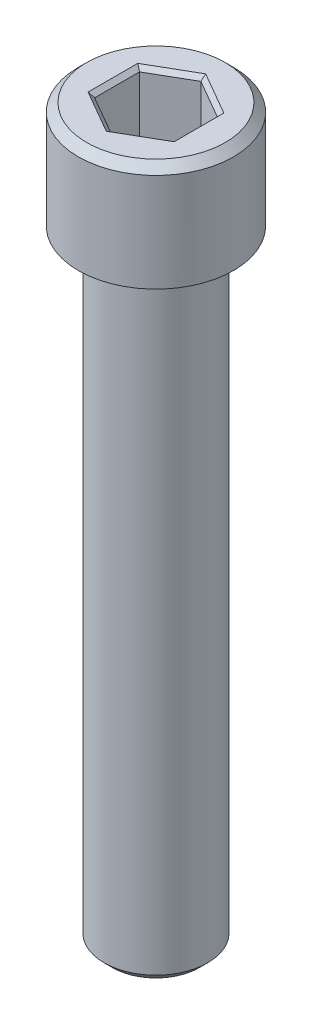
ISO-10303-21;
HEADER;
FILE_DESCRIPTION(('STEP AP214'),'2;1');
FILE_NAME('part.step','',(''),(''),'','','');
FILE_SCHEMA(('AUTOMOTIVE_DESIGN { 1 0 10303 214 1 1 1 1 }'));
ENDSEC;
DATA;
#1=APPLICATION_CONTEXT('core data for automotive mechanical design processes');
#2=APPLICATION_PROTOCOL_DEFINITION('international standard','automotive_design',2000,#1);
#3=PRODUCT_CONTEXT('',#1,'mechanical');
#4=PRODUCT('Part','Part','',(#3));
#5=PRODUCT_RELATED_PRODUCT_CATEGORY('part','',(#4));
#6=PRODUCT_DEFINITION_FORMATION('','',#4);
#7=PRODUCT_DEFINITION_CONTEXT('part definition',#1,'design');
#8=PRODUCT_DEFINITION('design','',#6,#7);
#9=PRODUCT_DEFINITION_SHAPE('','',#8);
#10=(LENGTH_UNIT() NAMED_UNIT(*) SI_UNIT(.MILLI.,.METRE.));
#11=(NAMED_UNIT(*) PLANE_ANGLE_UNIT() SI_UNIT($,.RADIAN.));
#12=(NAMED_UNIT(*) SI_UNIT($,.STERADIAN.) SOLID_ANGLE_UNIT());
#13=UNCERTAINTY_MEASURE_WITH_UNIT(LENGTH_MEASURE(1.E-05),#10,'distance_accuracy_value','');
#14=(GEOMETRIC_REPRESENTATION_CONTEXT(3) GLOBAL_UNCERTAINTY_ASSIGNED_CONTEXT((#13)) GLOBAL_UNIT_ASSIGNED_CONTEXT((#10,
#11,#12)) REPRESENTATION_CONTEXT('',''));
#15=CARTESIAN_POINT('',(0.,0.,0.));
#16=DIRECTION('',(0.,0.,1.));
#17=DIRECTION('',(1.,0.,0.));
#18=AXIS2_PLACEMENT_3D('',#15,#16,#17);
#19=CARTESIAN_POINT('',(-4.77519999999997,-4.57200000000002,0.));
#20=DIRECTION('',(0.,-1.,0.));
#21=DIRECTION('',(0.,0.,-1.));
#22=AXIS2_PLACEMENT_3D('',#19,#20,#21);
#23=PLANE('',#22);
#24=DIRECTION('',(-0.866025403784438,0.,0.5));
#25=VECTOR('',#24,1.);
#26=CARTESIAN_POINT('',(2.3876,-4.57200000000002,1.37848150271715));
#27=LINE('',#26,#25);
#28=CARTESIAN_POINT('',(2.3876,-4.57200000000002,1.37848150271715));
#29=VERTEX_POINT('',#28);
#30=CARTESIAN_POINT('',(0.,-4.57200000000002,2.7569630054343));
#31=VERTEX_POINT('',#30);
#32=EDGE_CURVE('E86',#29,#31,#27,.T.);
#33=ORIENTED_EDGE('',*,*,#32,.F.);
#34=DIRECTION('',(0.,0.,1.));
#35=VECTOR('',#34,1.);
#36=CARTESIAN_POINT('',(2.3876,-4.57200000000002,-1.37848150271715));
#37=LINE('',#36,#35);
#38=CARTESIAN_POINT('',(2.3876,-4.57200000000002,-1.37848150271715));
#39=VERTEX_POINT('',#38);
#40=EDGE_CURVE('E91',#39,#29,#37,.T.);
#41=ORIENTED_EDGE('',*,*,#40,.F.);
#42=DIRECTION('',(0.866025403784438,0.,0.5));
#43=VECTOR('',#42,1.);
#44=CARTESIAN_POINT('',(0.,-4.57200000000002,-2.75696300543429));
#45=LINE('',#44,#43);
#46=CARTESIAN_POINT('',(0.,-4.57200000000002,-2.75696300543429));
#47=VERTEX_POINT('',#46);
#48=EDGE_CURVE('E172',#47,#39,#45,.T.);
#49=ORIENTED_EDGE('',*,*,#48,.F.);
#50=DIRECTION('',(0.866025403784438,0.,-0.5));
#51=VECTOR('',#50,1.);
#52=CARTESIAN_POINT('',(-2.38759999999999,-4.57200000000002,-1.37848150271714));
#53=LINE('',#52,#51);
#54=CARTESIAN_POINT('',(-2.38759999999997,-4.57200000000002,-1.37848150271714));
#55=VERTEX_POINT('',#54);
#56=EDGE_CURVE('E178',#55,#47,#53,.T.);
#57=ORIENTED_EDGE('',*,*,#56,.F.);
#58=DIRECTION('',(0.,0.,-1.));
#59=VECTOR('',#58,1.);
#60=CARTESIAN_POINT('',(-2.38759999999996,-4.57200000000002,1.37848150271717));
#61=LINE('',#60,#59);
#62=CARTESIAN_POINT('',(-2.38759999999996,-4.57200000000002,1.37848150271717));
#63=VERTEX_POINT('',#62);
#64=EDGE_CURVE('E183',#63,#55,#61,.T.);
#65=ORIENTED_EDGE('',*,*,#64,.F.);
#66=DIRECTION('',(-0.866025403784438,0.,-0.500000000000001));
#67=VECTOR('',#66,1.);
#68=CARTESIAN_POINT('',(0.,-4.57200000000002,2.75696300543431));
#69=LINE('',#68,#67);
#70=EDGE_CURVE('E102',#31,#63,#69,.T.);
#71=ORIENTED_EDGE('',*,*,#70,.F.);
#72=EDGE_LOOP('',(#33,#41,#49,#57,#65,#71));
#73=FACE_BOUND('',#72,.T.);
#74=ADVANCED_FACE('F17',(#73),#23,.F.);
#75=CARTESIAN_POINT('',(2.3876,-4.57200000000002,-1.37848150271715));
#76=DIRECTION('',(-1.,0.,0.));
#77=DIRECTION('',(0.,0.,1.));
#78=AXIS2_PLACEMENT_3D('',#75,#76,#77);
#79=PLANE('',#78);
#80=DIRECTION('',(0.,1.,0.));
#81=VECTOR('',#80,1.);
#82=CARTESIAN_POINT('',(2.3876,-4.57200000000002,-1.37848150271715));
#83=LINE('',#82,#81);
#84=CARTESIAN_POINT('',(2.38760000000001,-0.253999999999981,-1.37848150271715));
#85=VERTEX_POINT('',#84);
#86=EDGE_CURVE('E96',#39,#85,#83,.T.);
#87=ORIENTED_EDGE('',*,*,#86,.F.);
#88=ORIENTED_EDGE('',*,*,#40,.T.);
#89=DIRECTION('',(0.,1.,0.));
#90=VECTOR('',#89,1.);
#91=CARTESIAN_POINT('',(2.3876,-4.57200000000002,1.37848150271715));
#92=LINE('',#91,#90);
#93=CARTESIAN_POINT('',(2.38760000000001,-0.25399999999998,1.37848150271715));
#94=VERTEX_POINT('',#93);
#95=EDGE_CURVE('E93',#94,#29,#92,.F.);
#96=ORIENTED_EDGE('',*,*,#95,.F.);
#97=DIRECTION('',(0.,0.,1.));
#98=VECTOR('',#97,1.);
#99=CARTESIAN_POINT('',(2.38760000000002,-0.25399999999999,0.));
#100=LINE('',#99,#98);
#101=EDGE_CURVE('E170',#94,#85,#100,.F.);
#102=ORIENTED_EDGE('',*,*,#101,.T.);
#103=EDGE_LOOP('',(#87,#88,#96,#102));
#104=FACE_BOUND('',#103,.T.);
#105=ADVANCED_FACE('F92',(#104),#79,.T.);
#106=CARTESIAN_POINT('',(2.3876,-4.57200000000002,1.37848150271715));
#107=DIRECTION('',(-0.5,0.,-0.866025403784438));
#108=DIRECTION('',(-0.866025403784438,0.,0.5));
#109=AXIS2_PLACEMENT_3D('',#106,#107,#108);
#110=PLANE('',#109);
#111=ORIENTED_EDGE('',*,*,#95,.T.);
#112=ORIENTED_EDGE('',*,*,#32,.T.);
#113=DIRECTION('',(0.,1.,0.));
#114=VECTOR('',#113,1.);
#115=CARTESIAN_POINT('',(0.,-4.57200000000002,2.75696300543431));
#116=LINE('',#115,#114);
#117=CARTESIAN_POINT('',(0.,-0.253999999999979,2.75696300543431));
#118=VERTEX_POINT('',#117);
#119=EDGE_CURVE('E104',#118,#31,#116,.F.);
#120=ORIENTED_EDGE('',*,*,#119,.F.);
#121=DIRECTION('',(0.866025403784438,0.,-0.500000000000001));
#122=VECTOR('',#121,1.);
#123=CARTESIAN_POINT('',(0.,-0.253999999999987,2.75696300543432));
#124=LINE('',#123,#122);
#125=EDGE_CURVE('E108',#118,#94,#124,.T.);
#126=ORIENTED_EDGE('',*,*,#125,.T.);
#127=EDGE_LOOP('',(#111,#112,#120,#126));
#128=FACE_BOUND('',#127,.T.);
#129=ADVANCED_FACE('F106',(#128),#110,.T.);
#130=CARTESIAN_POINT('',(0.,-4.57200000000002,2.75696300543431));
#131=DIRECTION('',(0.500000000000001,0.,-0.866025403784438));
#132=DIRECTION('',(-0.866025403784438,0.,-0.500000000000001));
#133=AXIS2_PLACEMENT_3D('',#130,#131,#132);
#134=PLANE('',#133);
#135=ORIENTED_EDGE('',*,*,#119,.T.);
#136=ORIENTED_EDGE('',*,*,#70,.T.);
#137=DIRECTION('',(0.,1.,0.));
#138=VECTOR('',#137,1.);
#139=CARTESIAN_POINT('',(-2.38759999999996,-4.57200000000002,1.37848150271717));
#140=LINE('',#139,#138);
#141=CARTESIAN_POINT('',(-2.38759999999997,-0.253999999999979,1.37848150271717));
#142=VERTEX_POINT('',#141);
#143=EDGE_CURVE('E185',#142,#63,#140,.F.);
#144=ORIENTED_EDGE('',*,*,#143,.F.);
#145=DIRECTION('',(0.866025403784438,0.,0.500000000000002));
#146=VECTOR('',#145,1.);
#147=CARTESIAN_POINT('',(-2.38759999999997,-0.253999999999992,1.37848150271718));
#148=LINE('',#147,#146);
#149=EDGE_CURVE('E164',#142,#118,#148,.T.);
#150=ORIENTED_EDGE('',*,*,#149,.T.);
#151=EDGE_LOOP('',(#135,#136,#144,#150));
#152=FACE_BOUND('',#151,.T.);
#153=ADVANCED_FACE('F189',(#152),#134,.T.);
#154=CARTESIAN_POINT('',(-2.38759999999996,-4.57200000000002,1.37848150271717));
#155=DIRECTION('',(1.,0.,0.));
#156=DIRECTION('',(0.,0.,-1.));
#157=AXIS2_PLACEMENT_3D('',#154,#155,#156);
#158=PLANE('',#157);
#159=ORIENTED_EDGE('',*,*,#143,.T.);
#160=ORIENTED_EDGE('',*,*,#64,.T.);
#161=DIRECTION('',(0.,1.,0.));
#162=VECTOR('',#161,1.);
#163=CARTESIAN_POINT('',(-2.38759999999999,-4.57200000000002,-1.37848150271714));
#164=LINE('',#163,#162);
#165=CARTESIAN_POINT('',(-2.38759999999998,-0.253999999999979,-1.37848150271714));
#166=VERTEX_POINT('',#165);
#167=EDGE_CURVE('E180',#166,#55,#164,.F.);
#168=ORIENTED_EDGE('',*,*,#167,.F.);
#169=DIRECTION('',(0.,0.,1.));
#170=VECTOR('',#169,1.);
#171=CARTESIAN_POINT('',(-2.3876,-0.253999999999983,0.));
#172=LINE('',#171,#170);
#173=EDGE_CURVE('E159',#166,#142,#172,.T.);
#174=ORIENTED_EDGE('',*,*,#173,.T.);
#175=EDGE_LOOP('',(#159,#160,#168,#174));
#176=FACE_BOUND('',#175,.T.);
#177=ADVANCED_FACE('F219',(#176),#158,.T.);
#178=CARTESIAN_POINT('',(-2.38759999999999,-4.57200000000002,-1.37848150271714));
#179=DIRECTION('',(0.5,0.,0.866025403784438));
#180=DIRECTION('',(0.866025403784438,0.,-0.5));
#181=AXIS2_PLACEMENT_3D('',#178,#179,#180);
#182=PLANE('',#181);
#183=ORIENTED_EDGE('',*,*,#167,.T.);
#184=ORIENTED_EDGE('',*,*,#56,.T.);
#185=DIRECTION('',(0.,1.,0.));
#186=VECTOR('',#185,1.);
#187=CARTESIAN_POINT('',(0.,-4.57200000000002,-2.75696300543429));
#188=LINE('',#187,#186);
#189=CARTESIAN_POINT('',(0.,-0.253999999999979,-2.7569630054343));
#190=VERTEX_POINT('',#189);
#191=EDGE_CURVE('E174',#190,#47,#188,.F.);
#192=ORIENTED_EDGE('',*,*,#191,.F.);
#193=DIRECTION('',(-0.866025403784438,0.,0.5));
#194=VECTOR('',#193,1.);
#195=CARTESIAN_POINT('',(0.,-0.253999999999991,-2.75696300543431));
#196=LINE('',#195,#194);
#197=EDGE_CURVE('E154',#190,#166,#196,.T.);
#198=ORIENTED_EDGE('',*,*,#197,.T.);
#199=EDGE_LOOP('',(#183,#184,#192,#198));
#200=FACE_BOUND('',#199,.T.);
#201=ADVANCED_FACE('F215',(#200),#182,.T.);
#202=CARTESIAN_POINT('',(0.,-4.57200000000002,-2.75696300543429));
#203=DIRECTION('',(-0.5,0.,0.866025403784438));
#204=DIRECTION('',(0.866025403784438,0.,0.5));
#205=AXIS2_PLACEMENT_3D('',#202,#203,#204);
#206=PLANE('',#205);
#207=ORIENTED_EDGE('',*,*,#191,.T.);
#208=ORIENTED_EDGE('',*,*,#48,.T.);
#209=ORIENTED_EDGE('',*,*,#86,.T.);
#210=DIRECTION('',(-0.866025403784438,0.,-0.5));
#211=VECTOR('',#210,1.);
#212=CARTESIAN_POINT('',(2.38760000000001,-0.253999999999982,-1.37848150271715));
#213=LINE('',#212,#211);
#214=EDGE_CURVE('E146',#85,#190,#213,.T.);
#215=ORIENTED_EDGE('',*,*,#214,.T.);
#216=EDGE_LOOP('',(#207,#208,#209,#215));
#217=FACE_BOUND('',#216,.T.);
#218=ADVANCED_FACE('F210',(#217),#206,.T.);
#219=CARTESIAN_POINT('',(2.64160000000001,0.,0.));
#220=DIRECTION('',(0.707106781186548,-0.707106781186547,0.));
#221=DIRECTION('',(0.707106781186547,0.707106781186548,0.));
#222=AXIS2_PLACEMENT_3D('',#219,#220,#221);
#223=PLANE('',#222);
#224=ORIENTED_EDGE('',*,*,#101,.F.);
#225=DIRECTION('',(0.654653670707951,0.654653670707987,0.377964473009256));
#226=VECTOR('',#225,1.);
#227=CARTESIAN_POINT('',(2.38760000000001,-0.253999999999991,1.37848150271716));
#228=LINE('',#227,#226);
#229=CARTESIAN_POINT('',(2.64160000000001,0.,1.52512847109134));
#230=VERTEX_POINT('',#229);
#231=EDGE_CURVE('E167',#94,#230,#228,.T.);
#232=ORIENTED_EDGE('',*,*,#231,.T.);
#233=DIRECTION('',(0.,0.,1.));
#234=VECTOR('',#233,1.);
#235=CARTESIAN_POINT('',(2.64160000000001,0.,0.));
#236=LINE('',#235,#234);
#237=CARTESIAN_POINT('',(2.64160000000001,0.,-1.52512847109129));
#238=VERTEX_POINT('',#237);
#239=EDGE_CURVE('E142',#238,#230,#236,.T.);
#240=ORIENTED_EDGE('',*,*,#239,.F.);
#241=DIRECTION('',(-0.654653670708017,-0.654653670707961,0.377964473009186));
#242=VECTOR('',#241,1.);
#243=CARTESIAN_POINT('',(2.64160000000001,0.,-1.52512847109129));
#244=LINE('',#243,#242);
#245=EDGE_CURVE('E149',#238,#85,#244,.T.);
#246=ORIENTED_EDGE('',*,*,#245,.T.);
#247=EDGE_LOOP('',(#224,#232,#240,#246));
#248=FACE_BOUND('',#247,.T.);
#249=ADVANCED_FACE('F205',(#248),#223,.F.);
#250=CARTESIAN_POINT('',(1.3208,0.,2.28769270663698));
#251=DIRECTION('',(0.353553390593274,-0.707106781186548,0.612372435695794));
#252=DIRECTION('',(0.,-0.654653670707976,-0.755928946018455));
#253=AXIS2_PLACEMENT_3D('',#250,#251,#252);
#254=PLANE('',#253);
#255=ORIENTED_EDGE('',*,*,#125,.F.);
#256=DIRECTION('',(0.,-0.654653670707977,-0.755928946018455));
#257=VECTOR('',#256,1.);
#258=CARTESIAN_POINT('',(0.,-0.377371428571426,2.61450595044226));
#259=LINE('',#258,#257);
#260=CARTESIAN_POINT('',(0.,0.,3.05025694218264));
#261=VERTEX_POINT('',#260);
#262=EDGE_CURVE('E162',#118,#261,#259,.F.);
#263=ORIENTED_EDGE('',*,*,#262,.T.);
#264=DIRECTION('',(-0.866025403784443,0.,0.499999999999993));
#265=VECTOR('',#264,1.);
#266=CARTESIAN_POINT('',(2.64160000000001,0.,1.52512847109135));
#267=LINE('',#266,#265);
#268=EDGE_CURVE('E139',#230,#261,#267,.T.);
#269=ORIENTED_EDGE('',*,*,#268,.F.);
#270=ORIENTED_EDGE('',*,*,#231,.F.);
#271=EDGE_LOOP('',(#255,#263,#269,#270));
#272=FACE_BOUND('',#271,.T.);
#273=ADVANCED_FACE('F196',(#272),#254,.F.);
#274=CARTESIAN_POINT('',(-1.3208,0.,2.28769270663698));
#275=DIRECTION('',(-0.353553390593274,-0.707106781186548,0.612372435695794));
#276=DIRECTION('',(0.,-0.654653670707977,-0.755928946018455));
#277=AXIS2_PLACEMENT_3D('',#274,#275,#276);
#278=PLANE('',#277);
#279=DIRECTION('',(-0.866025403784436,0.,-0.500000000000004));
#280=VECTOR('',#279,1.);
#281=CARTESIAN_POINT('',(0.,0.,3.05025694218264));
#282=LINE('',#281,#280);
#283=CARTESIAN_POINT('',(-2.64159999999998,0.,1.52512847109132));
#284=VERTEX_POINT('',#283);
#285=EDGE_CURVE('E136',#261,#284,#282,.T.);
#286=ORIENTED_EDGE('',*,*,#285,.F.);
#287=ORIENTED_EDGE('',*,*,#262,.F.);
#288=ORIENTED_EDGE('',*,*,#149,.F.);
#289=DIRECTION('',(-0.654653670707984,0.654653670707984,0.377964473009202));
#290=VECTOR('',#289,1.);
#291=CARTESIAN_POINT('',(-2.38759999999998,-0.253999999999997,1.37848150271717));
#292=LINE('',#291,#290);
#293=EDGE_CURVE('E157',#142,#284,#292,.T.);
#294=ORIENTED_EDGE('',*,*,#293,.T.);
#295=EDGE_LOOP('',(#286,#287,#288,#294));
#296=FACE_BOUND('',#295,.T.);
#297=ADVANCED_FACE('F199',(#296),#278,.F.);
#298=CARTESIAN_POINT('',(-2.64159999999998,0.,0.));
#299=DIRECTION('',(-0.707106781186548,-0.707106781186547,0.));
#300=DIRECTION('',(0.707106781186547,-0.707106781186548,0.));
#301=AXIS2_PLACEMENT_3D('',#298,#299,#300);
#302=PLANE('',#301);
#303=DIRECTION('',(0.,0.,1.));
#304=VECTOR('',#303,1.);
#305=CARTESIAN_POINT('',(-2.64159999999998,0.,0.));
#306=LINE('',#305,#304);
#307=CARTESIAN_POINT('',(-2.64159999999998,0.,-1.52512847109131));
#308=VERTEX_POINT('',#307);
#309=EDGE_CURVE('E133',#284,#308,#306,.F.);
#310=ORIENTED_EDGE('',*,*,#309,.F.);
#311=ORIENTED_EDGE('',*,*,#293,.F.);
#312=ORIENTED_EDGE('',*,*,#173,.F.);
#313=DIRECTION('',(-0.654653670707983,0.654653670707975,-0.377964473009221));
#314=VECTOR('',#313,1.);
#315=CARTESIAN_POINT('',(-2.3876,-0.253999999999991,-1.37848150271715));
#316=LINE('',#315,#314);
#317=EDGE_CURVE('E152',#166,#308,#316,.T.);
#318=ORIENTED_EDGE('',*,*,#317,.T.);
#319=EDGE_LOOP('',(#310,#311,#312,#318));
#320=FACE_BOUND('',#319,.T.);
#321=ADVANCED_FACE('F217',(#320),#302,.F.);
#322=CARTESIAN_POINT('',(-1.3208,0.,-2.28769270663697));
#323=DIRECTION('',(-0.353553390593274,-0.707106781186547,-0.612372435695795));
#324=DIRECTION('',(0.,0.654653670707977,-0.755928946018454));
#325=AXIS2_PLACEMENT_3D('',#322,#323,#324);
#326=PLANE('',#325);
#327=ORIENTED_EDGE('',*,*,#197,.F.);
#328=DIRECTION('',(0.,0.654653670707977,-0.755928946018455));
#329=VECTOR('',#328,1.);
#330=CARTESIAN_POINT('',(0.,-0.377371428571423,-2.61450595044224));
#331=LINE('',#330,#329);
#332=CARTESIAN_POINT('',(0.,0.,-3.05025694218262));
#333=VERTEX_POINT('',#332);
#334=EDGE_CURVE('E35',#190,#333,#331,.T.);
#335=ORIENTED_EDGE('',*,*,#334,.T.);
#336=DIRECTION('',(0.86602540378444,0.,-0.499999999999998));
#337=VECTOR('',#336,1.);
#338=CARTESIAN_POINT('',(-2.64159999999999,0.,-1.52512847109131));
#339=LINE('',#338,#337);
#340=EDGE_CURVE('E130',#308,#333,#339,.T.);
#341=ORIENTED_EDGE('',*,*,#340,.F.);
#342=ORIENTED_EDGE('',*,*,#317,.F.);
#343=EDGE_LOOP('',(#327,#335,#341,#342));
#344=FACE_BOUND('',#343,.T.);
#345=ADVANCED_FACE('F212',(#344),#326,.F.);
#346=CARTESIAN_POINT('',(1.3208,0.,-2.28769270663696));
#347=DIRECTION('',(0.353553390593274,-0.707106781186548,-0.612372435695794));
#348=DIRECTION('',(0.,0.654653670707977,-0.755928946018455));
#349=AXIS2_PLACEMENT_3D('',#346,#347,#348);
#350=PLANE('',#349);
#351=ORIENTED_EDGE('',*,*,#214,.F.);
#352=ORIENTED_EDGE('',*,*,#245,.F.);
#353=DIRECTION('',(0.866025403784436,0.,0.500000000000005));
#354=VECTOR('',#353,1.);
#355=CARTESIAN_POINT('',(0.,0.,-3.05025694218262));
#356=LINE('',#355,#354);
#357=EDGE_CURVE('E125',#333,#238,#356,.T.);
#358=ORIENTED_EDGE('',*,*,#357,.F.);
#359=ORIENTED_EDGE('',*,*,#334,.F.);
#360=EDGE_LOOP('',(#351,#352,#358,#359));
#361=FACE_BOUND('',#360,.T.);
#362=ADVANCED_FACE('F208',(#361),#350,.F.);
#363=CARTESIAN_POINT('',(0.,0.,0.));
#364=DIRECTION('',(0.,1.,0.));
#365=DIRECTION('',(0.,0.,1.));
#366=AXIS2_PLACEMENT_3D('',#363,#364,#365);
#367=PLANE('',#366);
#368=CARTESIAN_POINT('',(0.,0.,0.));
#369=DIRECTION('',(0.,-1.,0.));
#370=DIRECTION('',(0.,0.,-1.));
#371=AXIS2_PLACEMENT_3D('',#368,#369,#370);
#372=CIRCLE('',#371,4.25450000005867);
#373=CARTESIAN_POINT('',(0.,0.,-4.25450000005867));
#374=VERTEX_POINT('',#373);
#375=EDGE_CURVE('E20',#374,#374,#372,.T.);
#376=ORIENTED_EDGE('',*,*,#375,.F.);
#377=EDGE_LOOP('',(#376));
#378=FACE_BOUND('',#377,.T.);
#379=ORIENTED_EDGE('',*,*,#340,.T.);
#380=ORIENTED_EDGE('',*,*,#357,.T.);
#381=ORIENTED_EDGE('',*,*,#239,.T.);
#382=ORIENTED_EDGE('',*,*,#268,.T.);
#383=ORIENTED_EDGE('',*,*,#285,.T.);
#384=ORIENTED_EDGE('',*,*,#309,.T.);
#385=EDGE_LOOP('',(#379,#380,#381,#382,#383,#384));
#386=FACE_BOUND('',#385,.T.);
#387=ADVANCED_FACE('F202',(#378,#386),#367,.T.);
#388=CARTESIAN_POINT('',(0.,-0.507999999911135,0.));
#389=DIRECTION('',(0.,-1.,0.));
#390=DIRECTION('',(0.,0.,-1.));
#391=AXIS2_PLACEMENT_3D('',#388,#389,#390);
#392=CONICAL_SURFACE('',#391,4.76250000002665,0.785398163453397);
#393=CARTESIAN_POINT('',(0.,-0.507999999999953,0.));
#394=DIRECTION('',(0.,1.,0.));
#395=DIRECTION('',(0.,0.,1.));
#396=AXIS2_PLACEMENT_3D('',#393,#394,#395);
#397=CIRCLE('',#396,4.7625);
#398=CARTESIAN_POINT('',(0.,-0.507999999999953,4.7625));
#399=VERTEX_POINT('',#398);
#400=EDGE_CURVE('E117',#399,#399,#397,.F.);
#401=ORIENTED_EDGE('',*,*,#400,.F.);
#402=EDGE_LOOP('',(#401));
#403=FACE_BOUND('',#402,.T.);
#404=ORIENTED_EDGE('',*,*,#375,.T.);
#405=EDGE_LOOP('',(#404));
#406=FACE_BOUND('',#405,.T.);
#407=ADVANCED_FACE('F252',(#403,#406),#392,.T.);
#408=CARTESIAN_POINT('',(0.,-44.6531999999999,0.));
#409=DIRECTION('',(0.,-1.,0.));
#410=DIRECTION('',(0.,0.,-1.));
#411=AXIS2_PLACEMENT_3D('',#408,#409,#410);
#412=PLANE('',#411);
#413=CARTESIAN_POINT('',(0.,-44.6532000000275,0.));
#414=DIRECTION('',(0.,1.,0.));
#415=DIRECTION('',(0.,0.,1.));
#416=AXIS2_PLACEMENT_3D('',#413,#414,#415);
#417=CIRCLE('',#416,2.66700000003084);
#418=CARTESIAN_POINT('',(0.,-44.6532000000275,2.66700000003084));
#419=VERTEX_POINT('',#418);
#420=EDGE_CURVE('E115',#419,#419,#417,.T.);
#421=ORIENTED_EDGE('',*,*,#420,.F.);
#422=EDGE_LOOP('',(#421));
#423=FACE_BOUND('',#422,.T.);
#424=ADVANCED_FACE('F249',(#423),#412,.T.);
#425=CARTESIAN_POINT('',(0.,-6.55319999999992,0.));
#426=DIRECTION('',(0.,1.,0.));
#427=DIRECTION('',(0.,0.,1.));
#428=AXIS2_PLACEMENT_3D('',#425,#426,#427);
#429=CYLINDRICAL_SURFACE('',#428,4.7625);
#430=ORIENTED_EDGE('',*,*,#400,.T.);
#431=EDGE_LOOP('',(#430));
#432=FACE_BOUND('',#431,.T.);
#433=CARTESIAN_POINT('',(0.,-6.55319999999992,0.));
#434=DIRECTION('',(0.,1.,0.));
#435=DIRECTION('',(0.,0.,1.));
#436=AXIS2_PLACEMENT_3D('',#433,#434,#435);
#437=CIRCLE('',#436,4.7625);
#438=CARTESIAN_POINT('',(0.,-6.55319999999992,4.7625));
#439=VERTEX_POINT('',#438);
#440=EDGE_CURVE('E113',#439,#439,#437,.T.);
#441=ORIENTED_EDGE('',*,*,#440,.T.);
#442=EDGE_LOOP('',(#441));
#443=FACE_BOUND('',#442,.T.);
#444=ADVANCED_FACE('F245',(#432,#443),#429,.T.);
#445=CARTESIAN_POINT('',(0.,-44.1452000000027,0.));
#446=DIRECTION('',(0.,1.,0.));
#447=DIRECTION('',(0.,0.,1.));
#448=AXIS2_PLACEMENT_3D('',#445,#446,#447);
#449=CONICAL_SURFACE('',#448,3.17500000005566,0.785398163397448);
#450=CARTESIAN_POINT('',(0.,-44.1451999999999,0.));
#451=DIRECTION('',(0.,1.,0.));
#452=DIRECTION('',(0.,0.,1.));
#453=AXIS2_PLACEMENT_3D('',#450,#451,#452);
#454=CIRCLE('',#453,3.175);
#455=CARTESIAN_POINT('',(0.,-44.1451999999999,3.175));
#456=VERTEX_POINT('',#455);
#457=EDGE_CURVE('E26',#456,#456,#454,.T.);
#458=ORIENTED_EDGE('',*,*,#457,.F.);
#459=EDGE_LOOP('',(#458));
#460=FACE_BOUND('',#459,.T.);
#461=ORIENTED_EDGE('',*,*,#420,.T.);
#462=EDGE_LOOP('',(#461));
#463=FACE_BOUND('',#462,.T.);
#464=ADVANCED_FACE('F238',(#460,#463),#449,.T.);
#465=CARTESIAN_POINT('',(0.,-6.55319999999992,0.));
#466=DIRECTION('',(0.,1.,0.));
#467=DIRECTION('',(0.,0.,1.));
#468=AXIS2_PLACEMENT_3D('',#465,#466,#467);
#469=PLANE('',#468);
#470=ORIENTED_EDGE('',*,*,#440,.F.);
#471=EDGE_LOOP('',(#470));
#472=FACE_BOUND('',#471,.T.);
#473=CARTESIAN_POINT('',(0.,-6.55319999999993,0.));
#474=DIRECTION('',(0.,1.,0.));
#475=DIRECTION('',(0.,0.,1.));
#476=AXIS2_PLACEMENT_3D('',#473,#474,#475);
#477=CIRCLE('',#476,3.175);
#478=CARTESIAN_POINT('',(0.,-6.55319999999993,3.175));
#479=VERTEX_POINT('',#478);
#480=EDGE_CURVE('E11',#479,#479,#477,.F.);
#481=ORIENTED_EDGE('',*,*,#480,.F.);
#482=EDGE_LOOP('',(#481));
#483=FACE_BOUND('',#482,.T.);
#484=ADVANCED_FACE('F232',(#472,#483),#469,.F.);
#485=CARTESIAN_POINT('',(0.,-57.3531999999999,0.));
#486=DIRECTION('',(0.,1.,0.));
#487=DIRECTION('',(0.,0.,1.));
#488=AXIS2_PLACEMENT_3D('',#485,#486,#487);
#489=CYLINDRICAL_SURFACE('',#488,3.175);
#490=ORIENTED_EDGE('',*,*,#480,.T.);
#491=EDGE_LOOP('',(#490));
#492=FACE_BOUND('',#491,.T.);
#493=ORIENTED_EDGE('',*,*,#457,.T.);
#494=EDGE_LOOP('',(#493));
#495=FACE_BOUND('',#494,.T.);
#496=ADVANCED_FACE('F230',(#492,#495),#489,.T.);
#497=CLOSED_SHELL('',(#74,#105,#129,#153,#177,#201,#218,#249,#273,#297,#321,#345,#362,#387,#407,
#424,#444,#464,#484,#496));
#498=MANIFOLD_SOLID_BREP('B1',#497);
#499=ADVANCED_BREP_SHAPE_REPRESENTATION('',(#18,#498),#14);
#500=SHAPE_DEFINITION_REPRESENTATION(#9,#499);
ENDSEC;
END-ISO-10303-21;
